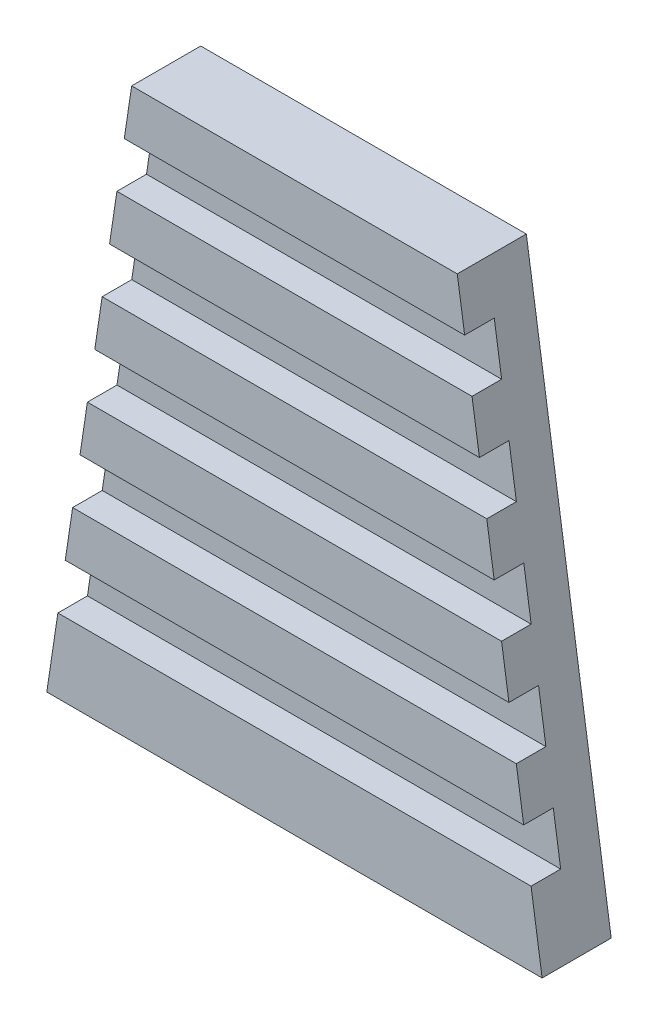
ISO-10303-21;
HEADER;
FILE_DESCRIPTION(('STEP AP214'),'2;1');
FILE_NAME('part.step','',(''),(''),'','','');
FILE_SCHEMA(('AUTOMOTIVE_DESIGN { 1 0 10303 214 1 1 1 1 }'));
ENDSEC;
DATA;
#1=APPLICATION_CONTEXT('core data for automotive mechanical design processes');
#2=APPLICATION_PROTOCOL_DEFINITION('international standard','automotive_design',2000,#1);
#3=PRODUCT_CONTEXT('',#1,'mechanical');
#4=PRODUCT('Part','Part','',(#3));
#5=PRODUCT_RELATED_PRODUCT_CATEGORY('part','',(#4));
#6=PRODUCT_DEFINITION_FORMATION('','',#4);
#7=PRODUCT_DEFINITION_CONTEXT('part definition',#1,'design');
#8=PRODUCT_DEFINITION('design','',#6,#7);
#9=PRODUCT_DEFINITION_SHAPE('','',#8);
#10=(LENGTH_UNIT() NAMED_UNIT(*) SI_UNIT(.MILLI.,.METRE.));
#11=(NAMED_UNIT(*) PLANE_ANGLE_UNIT() SI_UNIT($,.RADIAN.));
#12=(NAMED_UNIT(*) SI_UNIT($,.STERADIAN.) SOLID_ANGLE_UNIT());
#13=UNCERTAINTY_MEASURE_WITH_UNIT(LENGTH_MEASURE(1.E-05),#10,'distance_accuracy_value','');
#14=(GEOMETRIC_REPRESENTATION_CONTEXT(3) GLOBAL_UNCERTAINTY_ASSIGNED_CONTEXT((#13)) GLOBAL_UNIT_ASSIGNED_CONTEXT((#10,
#11,#12)) REPRESENTATION_CONTEXT('',''));
#15=CARTESIAN_POINT('',(0.,0.,0.));
#16=DIRECTION('',(0.,0.,1.));
#17=DIRECTION('',(1.,0.,0.));
#18=AXIS2_PLACEMENT_3D('',#15,#16,#17);
#19=CARTESIAN_POINT('',(-25.1,-28.75,4.));
#20=DIRECTION('',(0.,0.,-1.));
#21=DIRECTION('',(-1.,0.,0.));
#22=AXIS2_PLACEMENT_3D('',#19,#20,#21);
#23=PLANE('',#22);
#24=DIRECTION('',(1.,0.,0.));
#25=VECTOR('',#24,1.);
#26=CARTESIAN_POINT('',(-23.2304347826087,-16.25,4.));
#27=LINE('',#26,#25);
#28=CARTESIAN_POINT('',(-23.2304347826087,-16.25,4.));
#29=VERTEX_POINT('',#28);
#30=CARTESIAN_POINT('',(23.2304347826087,-16.25,4.));
#31=VERTEX_POINT('',#30);
#32=EDGE_CURVE('E393',#29,#31,#27,.T.);
#33=ORIENTED_EDGE('',*,*,#32,.F.);
#34=DIRECTION('',(-0.147919901899554,-0.988999344095852,0.));
#35=VECTOR('',#34,1.);
#36=CARTESIAN_POINT('',(-25.1,-28.75,4.));
#37=LINE('',#36,#35);
#38=CARTESIAN_POINT('',(-23.9782608695652,-21.25,4.));
#39=VERTEX_POINT('',#38);
#40=EDGE_CURVE('E217',#29,#39,#37,.T.);
#41=ORIENTED_EDGE('',*,*,#40,.T.);
#42=DIRECTION('',(-1.,0.,0.));
#43=VECTOR('',#42,1.);
#44=CARTESIAN_POINT('',(-23.9782608695652,-21.25,4.));
#45=LINE('',#44,#43);
#46=CARTESIAN_POINT('',(23.9782608695652,-21.25,4.));
#47=VERTEX_POINT('',#46);
#48=EDGE_CURVE('E324',#47,#39,#45,.T.);
#49=ORIENTED_EDGE('',*,*,#48,.F.);
#50=DIRECTION('',(-0.147919901899554,0.988999344095852,0.));
#51=VECTOR('',#50,1.);
#52=CARTESIAN_POINT('',(16.5,28.75,4.));
#53=LINE('',#52,#51);
#54=EDGE_CURVE('E56',#47,#31,#53,.T.);
#55=ORIENTED_EDGE('',*,*,#54,.T.);
#56=EDGE_LOOP('',(#33,#41,#49,#55));
#57=FACE_BOUND('',#56,.T.);
#58=ADVANCED_FACE('F30',(#57),#23,.F.);
#59=DIRECTION('',(-1.,0.,0.));
#60=VECTOR('',#59,1.);
#61=CARTESIAN_POINT('',(-22.4826086956522,-11.25,4.));
#62=LINE('',#61,#60);
#63=CARTESIAN_POINT('',(22.4826086956522,-11.25,4.));
#64=VERTEX_POINT('',#63);
#65=CARTESIAN_POINT('',(-22.4826086956522,-11.25,4.));
#66=VERTEX_POINT('',#65);
#67=EDGE_CURVE('E48',#64,#66,#62,.T.);
#68=ORIENTED_EDGE('',*,*,#67,.F.);
#69=CARTESIAN_POINT('',(21.7347826086956,-6.25,4.));
#70=VERTEX_POINT('',#69);
#71=EDGE_CURVE('E34',#64,#70,#53,.T.);
#72=ORIENTED_EDGE('',*,*,#71,.T.);
#73=DIRECTION('',(1.,0.,0.));
#74=VECTOR('',#73,1.);
#75=CARTESIAN_POINT('',(-21.7347826086957,-6.25000000000001,4.));
#76=LINE('',#75,#74);
#77=CARTESIAN_POINT('',(-21.7347826086957,-6.25000000000001,4.));
#78=VERTEX_POINT('',#77);
#79=EDGE_CURVE('E218',#78,#70,#76,.T.);
#80=ORIENTED_EDGE('',*,*,#79,.F.);
#81=EDGE_CURVE('E368',#78,#66,#37,.T.);
#82=ORIENTED_EDGE('',*,*,#81,.T.);
#83=EDGE_LOOP('',(#68,#72,#80,#82));
#84=FACE_BOUND('',#83,.T.);
#85=ADVANCED_FACE('F373',(#84),#23,.F.);
#86=DIRECTION('',(-1.,0.,0.));
#87=VECTOR('',#86,1.);
#88=CARTESIAN_POINT('',(-20.9869565217391,-1.25000000000001,4.));
#89=LINE('',#88,#87);
#90=CARTESIAN_POINT('',(20.9869565217391,-1.25000000000001,4.));
#91=VERTEX_POINT('',#90);
#92=CARTESIAN_POINT('',(-20.9869565217391,-1.25000000000002,4.));
#93=VERTEX_POINT('',#92);
#94=EDGE_CURVE('E221',#91,#93,#89,.T.);
#95=ORIENTED_EDGE('',*,*,#94,.F.);
#96=CARTESIAN_POINT('',(20.2391304347826,3.74999999999999,4.));
#97=VERTEX_POINT('',#96);
#98=EDGE_CURVE('E371',#91,#97,#53,.T.);
#99=ORIENTED_EDGE('',*,*,#98,.T.);
#100=DIRECTION('',(1.,0.,0.));
#101=VECTOR('',#100,1.);
#102=CARTESIAN_POINT('',(-20.2391304347826,3.74999999999999,4.));
#103=LINE('',#102,#101);
#104=CARTESIAN_POINT('',(-20.2391304347826,3.74999999999999,4.));
#105=VERTEX_POINT('',#104);
#106=EDGE_CURVE('E250',#105,#97,#103,.T.);
#107=ORIENTED_EDGE('',*,*,#106,.F.);
#108=EDGE_CURVE('E365',#105,#93,#37,.T.);
#109=ORIENTED_EDGE('',*,*,#108,.T.);
#110=EDGE_LOOP('',(#95,#99,#107,#109));
#111=FACE_BOUND('',#110,.T.);
#112=ADVANCED_FACE('F464',(#111),#23,.F.);
#113=DIRECTION('',(-1.,0.,0.));
#114=VECTOR('',#113,1.);
#115=CARTESIAN_POINT('',(-19.4913043478261,8.74999999999999,4.));
#116=LINE('',#115,#114);
#117=CARTESIAN_POINT('',(19.4913043478261,8.74999999999999,4.));
#118=VERTEX_POINT('',#117);
#119=CARTESIAN_POINT('',(-19.4913043478261,8.74999999999997,4.));
#120=VERTEX_POINT('',#119);
#121=EDGE_CURVE('E255',#118,#120,#116,.T.);
#122=ORIENTED_EDGE('',*,*,#121,.F.);
#123=CARTESIAN_POINT('',(18.7434782608696,13.75,4.));
#124=VERTEX_POINT('',#123);
#125=EDGE_CURVE('E370',#118,#124,#53,.T.);
#126=ORIENTED_EDGE('',*,*,#125,.T.);
#127=DIRECTION('',(1.,0.,0.));
#128=VECTOR('',#127,1.);
#129=CARTESIAN_POINT('',(-18.7434782608696,13.75,4.));
#130=LINE('',#129,#128);
#131=CARTESIAN_POINT('',(-18.7434782608696,13.75,4.));
#132=VERTEX_POINT('',#131);
#133=EDGE_CURVE('E277',#132,#124,#130,.T.);
#134=ORIENTED_EDGE('',*,*,#133,.F.);
#135=EDGE_CURVE('E355',#132,#120,#37,.T.);
#136=ORIENTED_EDGE('',*,*,#135,.T.);
#137=EDGE_LOOP('',(#122,#126,#134,#136));
#138=FACE_BOUND('',#137,.T.);
#139=ADVANCED_FACE('F448',(#138),#23,.F.);
#140=DIRECTION('',(-1.,0.,0.));
#141=VECTOR('',#140,1.);
#142=CARTESIAN_POINT('',(-17.995652173913,18.75,4.));
#143=LINE('',#142,#141);
#144=CARTESIAN_POINT('',(17.995652173913,18.75,4.));
#145=VERTEX_POINT('',#144);
#146=CARTESIAN_POINT('',(-17.995652173913,18.75,4.));
#147=VERTEX_POINT('',#146);
#148=EDGE_CURVE('E282',#145,#147,#143,.T.);
#149=ORIENTED_EDGE('',*,*,#148,.F.);
#150=CARTESIAN_POINT('',(17.2478260869565,23.75,4.));
#151=VERTEX_POINT('',#150);
#152=EDGE_CURVE('E422',#145,#151,#53,.T.);
#153=ORIENTED_EDGE('',*,*,#152,.T.);
#154=DIRECTION('',(1.,0.,0.));
#155=VECTOR('',#154,1.);
#156=CARTESIAN_POINT('',(-17.2478260869565,23.75,4.));
#157=LINE('',#156,#155);
#158=CARTESIAN_POINT('',(-17.2478260869565,23.75,4.));
#159=VERTEX_POINT('',#158);
#160=EDGE_CURVE('E304',#159,#151,#157,.T.);
#161=ORIENTED_EDGE('',*,*,#160,.F.);
#162=EDGE_CURVE('E352',#159,#147,#37,.T.);
#163=ORIENTED_EDGE('',*,*,#162,.T.);
#164=EDGE_LOOP('',(#149,#153,#161,#163));
#165=FACE_BOUND('',#164,.T.);
#166=ADVANCED_FACE('F444',(#165),#23,.F.);
#167=CARTESIAN_POINT('',(25.1,-28.75,4.));
#168=DIRECTION('',(0.,1.,0.));
#169=DIRECTION('',(0.,0.,1.));
#170=AXIS2_PLACEMENT_3D('',#167,#168,#169);
#171=PLANE('',#170);
#172=DIRECTION('',(1.,0.,0.));
#173=VECTOR('',#172,1.);
#174=CARTESIAN_POINT('',(25.1,-28.75,0.));
#175=LINE('',#174,#173);
#176=CARTESIAN_POINT('',(-25.1,-28.75,0.));
#177=VERTEX_POINT('',#176);
#178=CARTESIAN_POINT('',(25.1,-28.75,0.));
#179=VERTEX_POINT('',#178);
#180=EDGE_CURVE('E349',#177,#179,#175,.T.);
#181=ORIENTED_EDGE('',*,*,#180,.T.);
#182=DIRECTION('',(0.,0.,-1.));
#183=VECTOR('',#182,1.);
#184=CARTESIAN_POINT('',(25.1,-28.75,4.));
#185=LINE('',#184,#183);
#186=CARTESIAN_POINT('',(25.1,-28.75,7.));
#187=VERTEX_POINT('',#186);
#188=EDGE_CURVE('E11',#187,#179,#185,.T.);
#189=ORIENTED_EDGE('',*,*,#188,.F.);
#190=DIRECTION('',(1.,0.,0.));
#191=VECTOR('',#190,1.);
#192=CARTESIAN_POINT('',(-25.1,-28.75,7.));
#193=LINE('',#192,#191);
#194=CARTESIAN_POINT('',(-25.1,-28.75,7.));
#195=VERTEX_POINT('',#194);
#196=EDGE_CURVE('E328',#195,#187,#193,.T.);
#197=ORIENTED_EDGE('',*,*,#196,.F.);
#198=DIRECTION('',(0.,0.,-1.));
#199=VECTOR('',#198,1.);
#200=CARTESIAN_POINT('',(-25.1,-28.75,4.));
#201=LINE('',#200,#199);
#202=EDGE_CURVE('E354',#195,#177,#201,.T.);
#203=ORIENTED_EDGE('',*,*,#202,.T.);
#204=EDGE_LOOP('',(#181,#189,#197,#203));
#205=FACE_BOUND('',#204,.T.);
#206=ADVANCED_FACE('F32',(#205),#171,.F.);
#207=CARTESIAN_POINT('',(16.5,28.75,4.));
#208=DIRECTION('',(-0.988999344095852,-0.147919901899554,0.));
#209=DIRECTION('',(0.147919901899554,-0.988999344095853,0.));
#210=AXIS2_PLACEMENT_3D('',#207,#208,#209);
#211=PLANE('',#210);
#212=DIRECTION('',(-0.147919901899554,0.988999344095852,0.));
#213=VECTOR('',#212,1.);
#214=CARTESIAN_POINT('',(16.5,28.75,0.));
#215=LINE('',#214,#213);
#216=CARTESIAN_POINT('',(16.5,28.75,0.));
#217=VERTEX_POINT('',#216);
#218=EDGE_CURVE('E410',#179,#217,#215,.T.);
#219=ORIENTED_EDGE('',*,*,#218,.T.);
#220=DIRECTION('',(0.,0.,-1.));
#221=VECTOR('',#220,1.);
#222=CARTESIAN_POINT('',(16.5,28.75,4.));
#223=LINE('',#222,#221);
#224=CARTESIAN_POINT('',(16.5,28.75,7.));
#225=VERTEX_POINT('',#224);
#226=EDGE_CURVE('E40',#225,#217,#223,.T.);
#227=ORIENTED_EDGE('',*,*,#226,.F.);
#228=DIRECTION('',(-0.147919901899554,0.988999344095853,0.));
#229=VECTOR('',#228,1.);
#230=CARTESIAN_POINT('',(17.2478260869565,23.75,7.));
#231=LINE('',#230,#229);
#232=CARTESIAN_POINT('',(17.2478260869565,23.75,7.));
#233=VERTEX_POINT('',#232);
#234=EDGE_CURVE('E310',#233,#225,#231,.T.);
#235=ORIENTED_EDGE('',*,*,#234,.F.);
#236=DIRECTION('',(0.,0.,-1.));
#237=VECTOR('',#236,1.);
#238=CARTESIAN_POINT('',(17.2478260869565,23.75,7.));
#239=LINE('',#238,#237);
#240=EDGE_CURVE('E316',#233,#151,#239,.T.);
#241=ORIENTED_EDGE('',*,*,#240,.T.);
#242=ORIENTED_EDGE('',*,*,#152,.F.);
#243=DIRECTION('',(0.,0.,-1.));
#244=VECTOR('',#243,1.);
#245=CARTESIAN_POINT('',(17.9956521739131,18.75,7.));
#246=LINE('',#245,#244);
#247=CARTESIAN_POINT('',(17.9956521739131,18.75,7.));
#248=VERTEX_POINT('',#247);
#249=EDGE_CURVE('E295',#248,#145,#246,.T.);
#250=ORIENTED_EDGE('',*,*,#249,.F.);
#251=DIRECTION('',(-0.147919901899552,0.988999344095853,0.));
#252=VECTOR('',#251,1.);
#253=CARTESIAN_POINT('',(18.7434782608696,13.75,7.));
#254=LINE('',#253,#252);
#255=CARTESIAN_POINT('',(18.7434782608696,13.75,7.));
#256=VERTEX_POINT('',#255);
#257=EDGE_CURVE('E284',#256,#248,#254,.T.);
#258=ORIENTED_EDGE('',*,*,#257,.F.);
#259=DIRECTION('',(0.,0.,-1.));
#260=VECTOR('',#259,1.);
#261=CARTESIAN_POINT('',(18.7434782608696,13.75,7.));
#262=LINE('',#261,#260);
#263=EDGE_CURVE('E298',#256,#124,#262,.T.);
#264=ORIENTED_EDGE('',*,*,#263,.T.);
#265=ORIENTED_EDGE('',*,*,#125,.F.);
#266=DIRECTION('',(0.,0.,-1.));
#267=VECTOR('',#266,1.);
#268=CARTESIAN_POINT('',(19.4913043478261,8.74999999999999,7.));
#269=LINE('',#268,#267);
#270=CARTESIAN_POINT('',(19.4913043478261,8.74999999999999,7.));
#271=VERTEX_POINT('',#270);
#272=EDGE_CURVE('E268',#271,#118,#269,.T.);
#273=ORIENTED_EDGE('',*,*,#272,.F.);
#274=DIRECTION('',(-0.147919901899556,0.988999344095852,0.));
#275=VECTOR('',#274,1.);
#276=CARTESIAN_POINT('',(20.2391304347826,3.74999999999999,7.));
#277=LINE('',#276,#275);
#278=CARTESIAN_POINT('',(20.2391304347826,3.74999999999999,7.));
#279=VERTEX_POINT('',#278);
#280=EDGE_CURVE('E257',#279,#271,#277,.T.);
#281=ORIENTED_EDGE('',*,*,#280,.F.);
#282=DIRECTION('',(0.,0.,-1.));
#283=VECTOR('',#282,1.);
#284=CARTESIAN_POINT('',(20.2391304347826,3.74999999999999,7.));
#285=LINE('',#284,#283);
#286=EDGE_CURVE('E271',#279,#97,#285,.T.);
#287=ORIENTED_EDGE('',*,*,#286,.T.);
#288=ORIENTED_EDGE('',*,*,#98,.F.);
#289=DIRECTION('',(0.,0.,-1.));
#290=VECTOR('',#289,1.);
#291=CARTESIAN_POINT('',(20.9869565217391,-1.25000000000001,7.));
#292=LINE('',#291,#290);
#293=CARTESIAN_POINT('',(20.9869565217391,-1.25000000000001,7.));
#294=VERTEX_POINT('',#293);
#295=EDGE_CURVE('E241',#294,#91,#292,.T.);
#296=ORIENTED_EDGE('',*,*,#295,.F.);
#297=DIRECTION('',(-0.147919901899553,0.988999344095853,0.));
#298=VECTOR('',#297,1.);
#299=CARTESIAN_POINT('',(21.7347826086956,-6.25000000000001,7.));
#300=LINE('',#299,#298);
#301=CARTESIAN_POINT('',(21.7347826086956,-6.25000000000001,7.));
#302=VERTEX_POINT('',#301);
#303=EDGE_CURVE('E232',#302,#294,#300,.T.);
#304=ORIENTED_EDGE('',*,*,#303,.F.);
#305=DIRECTION('',(0.,0.,-1.));
#306=VECTOR('',#305,1.);
#307=CARTESIAN_POINT('',(21.7347826086956,-6.25000000000001,7.));
#308=LINE('',#307,#306);
#309=EDGE_CURVE('E244',#302,#70,#308,.T.);
#310=ORIENTED_EDGE('',*,*,#309,.T.);
#311=ORIENTED_EDGE('',*,*,#71,.F.);
#312=DIRECTION('',(0.,0.,-1.));
#313=VECTOR('',#312,1.);
#314=CARTESIAN_POINT('',(22.4826086956522,-11.25,7.));
#315=LINE('',#314,#313);
#316=CARTESIAN_POINT('',(22.4826086956522,-11.25,7.));
#317=VERTEX_POINT('',#316);
#318=EDGE_CURVE('E223',#317,#64,#315,.T.);
#319=ORIENTED_EDGE('',*,*,#318,.F.);
#320=DIRECTION('',(-0.147919901899552,0.988999344095853,0.));
#321=VECTOR('',#320,1.);
#322=CARTESIAN_POINT('',(23.2304347826087,-16.25,7.));
#323=LINE('',#322,#321);
#324=CARTESIAN_POINT('',(23.2304347826087,-16.25,7.));
#325=VERTEX_POINT('',#324);
#326=EDGE_CURVE('E204',#325,#317,#323,.T.);
#327=ORIENTED_EDGE('',*,*,#326,.F.);
#328=DIRECTION('',(0.,0.,-1.));
#329=VECTOR('',#328,1.);
#330=CARTESIAN_POINT('',(23.2304347826087,-16.25,7.));
#331=LINE('',#330,#329);
#332=EDGE_CURVE('E201',#325,#31,#331,.T.);
#333=ORIENTED_EDGE('',*,*,#332,.T.);
#334=ORIENTED_EDGE('',*,*,#54,.F.);
#335=DIRECTION('',(0.,0.,-1.));
#336=VECTOR('',#335,1.);
#337=CARTESIAN_POINT('',(23.9782608695652,-21.25,7.));
#338=LINE('',#337,#336);
#339=CARTESIAN_POINT('',(23.9782608695652,-21.25,7.));
#340=VERTEX_POINT('',#339);
#341=EDGE_CURVE('E344',#340,#47,#338,.T.);
#342=ORIENTED_EDGE('',*,*,#341,.F.);
#343=DIRECTION('',(-0.147919901899554,0.988999344095853,0.));
#344=VECTOR('',#343,1.);
#345=CARTESIAN_POINT('',(25.1,-28.75,7.));
#346=LINE('',#345,#344);
#347=EDGE_CURVE('E331',#187,#340,#346,.T.);
#348=ORIENTED_EDGE('',*,*,#347,.F.);
#349=ORIENTED_EDGE('',*,*,#188,.T.);
#350=EDGE_LOOP('',(#219,#227,#235,#241,#242,#250,#258,#264,#265,#273,#281,#287,#288,#296,#304,
#310,#311,#319,#327,#333,#334,#342,#348,#349));
#351=FACE_BOUND('',#350,.T.);
#352=ADVANCED_FACE('F382',(#351),#211,.F.);
#353=CARTESIAN_POINT('',(-16.5,28.75,4.));
#354=DIRECTION('',(0.,-1.,0.));
#355=DIRECTION('',(0.,0.,-1.));
#356=AXIS2_PLACEMENT_3D('',#353,#354,#355);
#357=PLANE('',#356);
#358=DIRECTION('',(-1.,0.,0.));
#359=VECTOR('',#358,1.);
#360=CARTESIAN_POINT('',(-16.5,28.75,0.));
#361=LINE('',#360,#359);
#362=CARTESIAN_POINT('',(-16.5,28.75,0.));
#363=VERTEX_POINT('',#362);
#364=EDGE_CURVE('E417',#217,#363,#361,.T.);
#365=ORIENTED_EDGE('',*,*,#364,.T.);
#366=DIRECTION('',(0.,0.,-1.));
#367=VECTOR('',#366,1.);
#368=CARTESIAN_POINT('',(-16.5,28.75,4.));
#369=LINE('',#368,#367);
#370=CARTESIAN_POINT('',(-16.5,28.75,7.));
#371=VERTEX_POINT('',#370);
#372=EDGE_CURVE('E424',#371,#363,#369,.T.);
#373=ORIENTED_EDGE('',*,*,#372,.F.);
#374=DIRECTION('',(-1.,0.,0.));
#375=VECTOR('',#374,1.);
#376=CARTESIAN_POINT('',(16.5,28.75,7.));
#377=LINE('',#376,#375);
#378=EDGE_CURVE('E313',#225,#371,#377,.T.);
#379=ORIENTED_EDGE('',*,*,#378,.F.);
#380=ORIENTED_EDGE('',*,*,#226,.T.);
#381=EDGE_LOOP('',(#365,#373,#379,#380));
#382=FACE_BOUND('',#381,.T.);
#383=ADVANCED_FACE('F430',(#382),#357,.F.);
#384=CARTESIAN_POINT('',(-25.1,-28.75,4.));
#385=DIRECTION('',(0.988999344095852,-0.147919901899554,0.));
#386=DIRECTION('',(0.147919901899554,0.988999344095853,0.));
#387=AXIS2_PLACEMENT_3D('',#384,#385,#386);
#388=PLANE('',#387);
#389=DIRECTION('',(-0.147919901899554,-0.988999344095852,0.));
#390=VECTOR('',#389,1.);
#391=CARTESIAN_POINT('',(-25.1,-28.75,0.));
#392=LINE('',#391,#390);
#393=EDGE_CURVE('E418',#363,#177,#392,.T.);
#394=ORIENTED_EDGE('',*,*,#393,.T.);
#395=ORIENTED_EDGE('',*,*,#202,.F.);
#396=DIRECTION('',(-0.147919901899554,-0.988999344095853,0.));
#397=VECTOR('',#396,1.);
#398=CARTESIAN_POINT('',(-23.9782608695652,-21.25,7.));
#399=LINE('',#398,#397);
#400=CARTESIAN_POINT('',(-23.9782608695652,-21.25,7.));
#401=VERTEX_POINT('',#400);
#402=EDGE_CURVE('E325',#401,#195,#399,.T.);
#403=ORIENTED_EDGE('',*,*,#402,.F.);
#404=DIRECTION('',(0.,0.,-1.));
#405=VECTOR('',#404,1.);
#406=CARTESIAN_POINT('',(-23.9782608695652,-21.25,7.));
#407=LINE('',#406,#405);
#408=EDGE_CURVE('E335',#401,#39,#407,.T.);
#409=ORIENTED_EDGE('',*,*,#408,.T.);
#410=ORIENTED_EDGE('',*,*,#40,.F.);
#411=DIRECTION('',(0.,0.,-1.));
#412=VECTOR('',#411,1.);
#413=CARTESIAN_POINT('',(-23.2304347826087,-16.25,7.));
#414=LINE('',#413,#412);
#415=CARTESIAN_POINT('',(-23.2304347826087,-16.25,7.));
#416=VERTEX_POINT('',#415);
#417=EDGE_CURVE('E199',#416,#29,#414,.T.);
#418=ORIENTED_EDGE('',*,*,#417,.F.);
#419=DIRECTION('',(-0.147919901899554,-0.988999344095853,0.));
#420=VECTOR('',#419,1.);
#421=CARTESIAN_POINT('',(-22.4826086956522,-11.25,7.));
#422=LINE('',#421,#420);
#423=CARTESIAN_POINT('',(-22.4826086956522,-11.25,7.));
#424=VERTEX_POINT('',#423);
#425=EDGE_CURVE('E205',#424,#416,#422,.T.);
#426=ORIENTED_EDGE('',*,*,#425,.F.);
#427=DIRECTION('',(0.,0.,-1.));
#428=VECTOR('',#427,1.);
#429=CARTESIAN_POINT('',(-22.4826086956522,-11.25,7.));
#430=LINE('',#429,#428);
#431=EDGE_CURVE('E390',#424,#66,#430,.T.);
#432=ORIENTED_EDGE('',*,*,#431,.T.);
#433=ORIENTED_EDGE('',*,*,#81,.F.);
#434=DIRECTION('',(0.,0.,-1.));
#435=VECTOR('',#434,1.);
#436=CARTESIAN_POINT('',(-21.7347826086957,-6.25000000000001,7.));
#437=LINE('',#436,#435);
#438=CARTESIAN_POINT('',(-21.7347826086957,-6.25000000000001,7.));
#439=VERTEX_POINT('',#438);
#440=EDGE_CURVE('E247',#439,#78,#437,.T.);
#441=ORIENTED_EDGE('',*,*,#440,.F.);
#442=DIRECTION('',(-0.147919901899554,-0.988999344095853,0.));
#443=VECTOR('',#442,1.);
#444=CARTESIAN_POINT('',(-20.9869565217391,-1.25000000000001,7.));
#445=LINE('',#444,#443);
#446=CARTESIAN_POINT('',(-20.9869565217391,-1.25000000000001,7.));
#447=VERTEX_POINT('',#446);
#448=EDGE_CURVE('E227',#447,#439,#445,.T.);
#449=ORIENTED_EDGE('',*,*,#448,.F.);
#450=DIRECTION('',(0.,0.,-1.));
#451=VECTOR('',#450,1.);
#452=CARTESIAN_POINT('',(-20.9869565217391,-1.25000000000001,7.));
#453=LINE('',#452,#451);
#454=EDGE_CURVE('E235',#447,#93,#453,.T.);
#455=ORIENTED_EDGE('',*,*,#454,.T.);
#456=ORIENTED_EDGE('',*,*,#108,.F.);
#457=DIRECTION('',(0.,0.,-1.));
#458=VECTOR('',#457,1.);
#459=CARTESIAN_POINT('',(-20.2391304347826,3.74999999999999,7.));
#460=LINE('',#459,#458);
#461=CARTESIAN_POINT('',(-20.2391304347826,3.74999999999999,7.));
#462=VERTEX_POINT('',#461);
#463=EDGE_CURVE('E274',#462,#105,#460,.T.);
#464=ORIENTED_EDGE('',*,*,#463,.F.);
#465=DIRECTION('',(-0.147919901899554,-0.988999344095853,0.));
#466=VECTOR('',#465,1.);
#467=CARTESIAN_POINT('',(-19.4913043478261,8.74999999999999,7.));
#468=LINE('',#467,#466);
#469=CARTESIAN_POINT('',(-19.4913043478261,8.74999999999999,7.));
#470=VERTEX_POINT('',#469);
#471=EDGE_CURVE('E251',#470,#462,#468,.T.);
#472=ORIENTED_EDGE('',*,*,#471,.F.);
#473=DIRECTION('',(0.,0.,-1.));
#474=VECTOR('',#473,1.);
#475=CARTESIAN_POINT('',(-19.4913043478261,8.74999999999999,7.));
#476=LINE('',#475,#474);
#477=EDGE_CURVE('E261',#470,#120,#476,.T.);
#478=ORIENTED_EDGE('',*,*,#477,.T.);
#479=ORIENTED_EDGE('',*,*,#135,.F.);
#480=DIRECTION('',(0.,0.,-1.));
#481=VECTOR('',#480,1.);
#482=CARTESIAN_POINT('',(-18.7434782608696,13.75,7.));
#483=LINE('',#482,#481);
#484=CARTESIAN_POINT('',(-18.7434782608696,13.75,7.));
#485=VERTEX_POINT('',#484);
#486=EDGE_CURVE('E301',#485,#132,#483,.T.);
#487=ORIENTED_EDGE('',*,*,#486,.F.);
#488=DIRECTION('',(-0.147919901899554,-0.988999344095853,0.));
#489=VECTOR('',#488,1.);
#490=CARTESIAN_POINT('',(-17.995652173913,18.75,7.));
#491=LINE('',#490,#489);
#492=CARTESIAN_POINT('',(-17.995652173913,18.75,7.));
#493=VERTEX_POINT('',#492);
#494=EDGE_CURVE('E278',#493,#485,#491,.T.);
#495=ORIENTED_EDGE('',*,*,#494,.F.);
#496=DIRECTION('',(0.,0.,-1.));
#497=VECTOR('',#496,1.);
#498=CARTESIAN_POINT('',(-17.995652173913,18.75,7.));
#499=LINE('',#498,#497);
#500=EDGE_CURVE('E288',#493,#147,#499,.T.);
#501=ORIENTED_EDGE('',*,*,#500,.T.);
#502=ORIENTED_EDGE('',*,*,#162,.F.);
#503=DIRECTION('',(0.,0.,-1.));
#504=VECTOR('',#503,1.);
#505=CARTESIAN_POINT('',(-17.2478260869565,23.75,7.));
#506=LINE('',#505,#504);
#507=CARTESIAN_POINT('',(-17.2478260869565,23.75,7.));
#508=VERTEX_POINT('',#507);
#509=EDGE_CURVE('E321',#508,#159,#506,.T.);
#510=ORIENTED_EDGE('',*,*,#509,.F.);
#511=DIRECTION('',(-0.147919901899554,-0.988999344095853,0.));
#512=VECTOR('',#511,1.);
#513=CARTESIAN_POINT('',(-16.5,28.75,7.));
#514=LINE('',#513,#512);
#515=EDGE_CURVE('E305',#371,#508,#514,.T.);
#516=ORIENTED_EDGE('',*,*,#515,.F.);
#517=ORIENTED_EDGE('',*,*,#372,.T.);
#518=EDGE_LOOP('',(#394,#395,#403,#409,#410,#418,#426,#432,#433,#441,#449,#455,#456,#464,#472,
#478,#479,#487,#495,#501,#502,#510,#516,#517));
#519=FACE_BOUND('',#518,.T.);
#520=ADVANCED_FACE('F215',(#519),#388,.F.);
#521=CARTESIAN_POINT('',(-25.1,-28.75,0.));
#522=DIRECTION('',(0.,0.,-1.));
#523=DIRECTION('',(-1.,0.,0.));
#524=AXIS2_PLACEMENT_3D('',#521,#522,#523);
#525=PLANE('',#524);
#526=ORIENTED_EDGE('',*,*,#180,.F.);
#527=ORIENTED_EDGE('',*,*,#393,.F.);
#528=ORIENTED_EDGE('',*,*,#364,.F.);
#529=ORIENTED_EDGE('',*,*,#218,.F.);
#530=EDGE_LOOP('',(#526,#527,#528,#529));
#531=FACE_BOUND('',#530,.T.);
#532=ADVANCED_FACE('F432',(#531),#525,.T.);
#533=CARTESIAN_POINT('',(-23.9782608695652,-21.25,7.));
#534=DIRECTION('',(0.,-1.,0.));
#535=DIRECTION('',(0.,0.,-1.));
#536=AXIS2_PLACEMENT_3D('',#533,#534,#535);
#537=PLANE('',#536);
#538=ORIENTED_EDGE('',*,*,#48,.T.);
#539=ORIENTED_EDGE('',*,*,#408,.F.);
#540=DIRECTION('',(-1.,0.,0.));
#541=VECTOR('',#540,1.);
#542=CARTESIAN_POINT('',(-23.9782608695652,-21.25,7.));
#543=LINE('',#542,#541);
#544=EDGE_CURVE('E333',#340,#401,#543,.T.);
#545=ORIENTED_EDGE('',*,*,#544,.F.);
#546=ORIENTED_EDGE('',*,*,#341,.T.);
#547=EDGE_LOOP('',(#538,#539,#545,#546));
#548=FACE_BOUND('',#547,.T.);
#549=ADVANCED_FACE('F403',(#548),#537,.F.);
#550=CARTESIAN_POINT('',(-25.1,-28.75,7.));
#551=DIRECTION('',(0.,0.,1.));
#552=DIRECTION('',(1.,0.,0.));
#553=AXIS2_PLACEMENT_3D('',#550,#551,#552);
#554=PLANE('',#553);
#555=ORIENTED_EDGE('',*,*,#402,.T.);
#556=ORIENTED_EDGE('',*,*,#196,.T.);
#557=ORIENTED_EDGE('',*,*,#347,.T.);
#558=ORIENTED_EDGE('',*,*,#544,.T.);
#559=EDGE_LOOP('',(#555,#556,#557,#558));
#560=FACE_BOUND('',#559,.T.);
#561=ADVANCED_FACE('F407',(#560),#554,.T.);
#562=CARTESIAN_POINT('',(-17.2478260869565,23.75,7.));
#563=DIRECTION('',(0.,1.,0.));
#564=DIRECTION('',(0.,0.,1.));
#565=AXIS2_PLACEMENT_3D('',#562,#563,#564);
#566=PLANE('',#565);
#567=ORIENTED_EDGE('',*,*,#160,.T.);
#568=ORIENTED_EDGE('',*,*,#240,.F.);
#569=DIRECTION('',(1.,0.,0.));
#570=VECTOR('',#569,1.);
#571=CARTESIAN_POINT('',(-17.2478260869565,23.75,7.));
#572=LINE('',#571,#570);
#573=EDGE_CURVE('E308',#508,#233,#572,.T.);
#574=ORIENTED_EDGE('',*,*,#573,.F.);
#575=ORIENTED_EDGE('',*,*,#509,.T.);
#576=EDGE_LOOP('',(#567,#568,#574,#575));
#577=FACE_BOUND('',#576,.T.);
#578=ADVANCED_FACE('F441',(#577),#566,.F.);
#579=CARTESIAN_POINT('',(-17.2478260869565,23.75,7.));
#580=DIRECTION('',(0.,0.,1.));
#581=DIRECTION('',(1.,0.,0.));
#582=AXIS2_PLACEMENT_3D('',#579,#580,#581);
#583=PLANE('',#582);
#584=ORIENTED_EDGE('',*,*,#515,.T.);
#585=ORIENTED_EDGE('',*,*,#573,.T.);
#586=ORIENTED_EDGE('',*,*,#234,.T.);
#587=ORIENTED_EDGE('',*,*,#378,.T.);
#588=EDGE_LOOP('',(#584,#585,#586,#587));
#589=FACE_BOUND('',#588,.T.);
#590=ADVANCED_FACE('F436',(#589),#583,.T.);
#591=CARTESIAN_POINT('',(-18.7434782608696,13.75,7.));
#592=DIRECTION('',(0.,1.,0.));
#593=DIRECTION('',(0.,0.,1.));
#594=AXIS2_PLACEMENT_3D('',#591,#592,#593);
#595=PLANE('',#594);
#596=ORIENTED_EDGE('',*,*,#133,.T.);
#597=ORIENTED_EDGE('',*,*,#263,.F.);
#598=DIRECTION('',(1.,0.,0.));
#599=VECTOR('',#598,1.);
#600=CARTESIAN_POINT('',(-18.7434782608696,13.75,7.));
#601=LINE('',#600,#599);
#602=EDGE_CURVE('E281',#485,#256,#601,.T.);
#603=ORIENTED_EDGE('',*,*,#602,.F.);
#604=ORIENTED_EDGE('',*,*,#486,.T.);
#605=EDGE_LOOP('',(#596,#597,#603,#604));
#606=FACE_BOUND('',#605,.T.);
#607=ADVANCED_FACE('F452',(#606),#595,.F.);
#608=CARTESIAN_POINT('',(-17.995652173913,18.75,7.));
#609=DIRECTION('',(0.,-1.,0.));
#610=DIRECTION('',(0.,0.,-1.));
#611=AXIS2_PLACEMENT_3D('',#608,#609,#610);
#612=PLANE('',#611);
#613=ORIENTED_EDGE('',*,*,#148,.T.);
#614=ORIENTED_EDGE('',*,*,#500,.F.);
#615=DIRECTION('',(-1.,0.,0.));
#616=VECTOR('',#615,1.);
#617=CARTESIAN_POINT('',(-17.995652173913,18.75,7.));
#618=LINE('',#617,#616);
#619=EDGE_CURVE('E286',#248,#493,#618,.T.);
#620=ORIENTED_EDGE('',*,*,#619,.F.);
#621=ORIENTED_EDGE('',*,*,#249,.T.);
#622=EDGE_LOOP('',(#613,#614,#620,#621));
#623=FACE_BOUND('',#622,.T.);
#624=ADVANCED_FACE('F547',(#623),#612,.F.);
#625=CARTESIAN_POINT('',(-18.7434782608696,13.75,7.));
#626=DIRECTION('',(0.,0.,1.));
#627=DIRECTION('',(1.,0.,0.));
#628=AXIS2_PLACEMENT_3D('',#625,#626,#627);
#629=PLANE('',#628);
#630=ORIENTED_EDGE('',*,*,#494,.T.);
#631=ORIENTED_EDGE('',*,*,#602,.T.);
#632=ORIENTED_EDGE('',*,*,#257,.T.);
#633=ORIENTED_EDGE('',*,*,#619,.T.);
#634=EDGE_LOOP('',(#630,#631,#632,#633));
#635=FACE_BOUND('',#634,.T.);
#636=ADVANCED_FACE('F457',(#635),#629,.T.);
#637=CARTESIAN_POINT('',(-20.2391304347826,3.74999999999999,7.));
#638=DIRECTION('',(0.,1.,0.));
#639=DIRECTION('',(0.,0.,1.));
#640=AXIS2_PLACEMENT_3D('',#637,#638,#639);
#641=PLANE('',#640);
#642=ORIENTED_EDGE('',*,*,#106,.T.);
#643=ORIENTED_EDGE('',*,*,#286,.F.);
#644=DIRECTION('',(1.,0.,0.));
#645=VECTOR('',#644,1.);
#646=CARTESIAN_POINT('',(-20.2391304347826,3.74999999999999,7.));
#647=LINE('',#646,#645);
#648=EDGE_CURVE('E254',#462,#279,#647,.T.);
#649=ORIENTED_EDGE('',*,*,#648,.F.);
#650=ORIENTED_EDGE('',*,*,#463,.T.);
#651=EDGE_LOOP('',(#642,#643,#649,#650));
#652=FACE_BOUND('',#651,.T.);
#653=ADVANCED_FACE('F561',(#652),#641,.F.);
#654=CARTESIAN_POINT('',(-19.4913043478261,8.74999999999999,7.));
#655=DIRECTION('',(0.,-1.,0.));
#656=DIRECTION('',(0.,0.,-1.));
#657=AXIS2_PLACEMENT_3D('',#654,#655,#656);
#658=PLANE('',#657);
#659=ORIENTED_EDGE('',*,*,#121,.T.);
#660=ORIENTED_EDGE('',*,*,#477,.F.);
#661=DIRECTION('',(-1.,0.,0.));
#662=VECTOR('',#661,1.);
#663=CARTESIAN_POINT('',(-19.4913043478261,8.74999999999999,7.));
#664=LINE('',#663,#662);
#665=EDGE_CURVE('E259',#271,#470,#664,.T.);
#666=ORIENTED_EDGE('',*,*,#665,.F.);
#667=ORIENTED_EDGE('',*,*,#272,.T.);
#668=EDGE_LOOP('',(#659,#660,#666,#667));
#669=FACE_BOUND('',#668,.T.);
#670=ADVANCED_FACE('F568',(#669),#658,.F.);
#671=CARTESIAN_POINT('',(-20.2391304347826,3.74999999999999,7.));
#672=DIRECTION('',(0.,0.,1.));
#673=DIRECTION('',(1.,0.,0.));
#674=AXIS2_PLACEMENT_3D('',#671,#672,#673);
#675=PLANE('',#674);
#676=ORIENTED_EDGE('',*,*,#471,.T.);
#677=ORIENTED_EDGE('',*,*,#648,.T.);
#678=ORIENTED_EDGE('',*,*,#280,.T.);
#679=ORIENTED_EDGE('',*,*,#665,.T.);
#680=EDGE_LOOP('',(#676,#677,#678,#679));
#681=FACE_BOUND('',#680,.T.);
#682=ADVANCED_FACE('F475',(#681),#675,.T.);
#683=CARTESIAN_POINT('',(-21.7347826086957,-6.25000000000001,7.));
#684=DIRECTION('',(0.,1.,0.));
#685=DIRECTION('',(0.,0.,1.));
#686=AXIS2_PLACEMENT_3D('',#683,#684,#685);
#687=PLANE('',#686);
#688=ORIENTED_EDGE('',*,*,#79,.T.);
#689=ORIENTED_EDGE('',*,*,#309,.F.);
#690=DIRECTION('',(1.,0.,0.));
#691=VECTOR('',#690,1.);
#692=CARTESIAN_POINT('',(-21.7347826086957,-6.25000000000001,7.));
#693=LINE('',#692,#691);
#694=EDGE_CURVE('E230',#439,#302,#693,.T.);
#695=ORIENTED_EDGE('',*,*,#694,.F.);
#696=ORIENTED_EDGE('',*,*,#440,.T.);
#697=EDGE_LOOP('',(#688,#689,#695,#696));
#698=FACE_BOUND('',#697,.T.);
#699=ADVANCED_FACE('F379',(#698),#687,.F.);
#700=CARTESIAN_POINT('',(-20.9869565217391,-1.25000000000001,7.));
#701=DIRECTION('',(0.,-1.,0.));
#702=DIRECTION('',(0.,0.,-1.));
#703=AXIS2_PLACEMENT_3D('',#700,#701,#702);
#704=PLANE('',#703);
#705=ORIENTED_EDGE('',*,*,#94,.T.);
#706=ORIENTED_EDGE('',*,*,#454,.F.);
#707=DIRECTION('',(-1.,0.,0.));
#708=VECTOR('',#707,1.);
#709=CARTESIAN_POINT('',(-20.9869565217391,-1.25000000000001,7.));
#710=LINE('',#709,#708);
#711=EDGE_CURVE('E234',#294,#447,#710,.T.);
#712=ORIENTED_EDGE('',*,*,#711,.F.);
#713=ORIENTED_EDGE('',*,*,#295,.T.);
#714=EDGE_LOOP('',(#705,#706,#712,#713));
#715=FACE_BOUND('',#714,.T.);
#716=ADVANCED_FACE('F467',(#715),#704,.F.);
#717=CARTESIAN_POINT('',(-21.7347826086957,-6.25000000000001,7.));
#718=DIRECTION('',(0.,0.,1.));
#719=DIRECTION('',(1.,0.,0.));
#720=AXIS2_PLACEMENT_3D('',#717,#718,#719);
#721=PLANE('',#720);
#722=ORIENTED_EDGE('',*,*,#448,.T.);
#723=ORIENTED_EDGE('',*,*,#694,.T.);
#724=ORIENTED_EDGE('',*,*,#303,.T.);
#725=ORIENTED_EDGE('',*,*,#711,.T.);
#726=EDGE_LOOP('',(#722,#723,#724,#725));
#727=FACE_BOUND('',#726,.T.);
#728=ADVANCED_FACE('F387',(#727),#721,.T.);
#729=CARTESIAN_POINT('',(-23.2304347826087,-16.25,7.));
#730=DIRECTION('',(0.,1.,0.));
#731=DIRECTION('',(0.,0.,1.));
#732=AXIS2_PLACEMENT_3D('',#729,#730,#731);
#733=PLANE('',#732);
#734=ORIENTED_EDGE('',*,*,#32,.T.);
#735=ORIENTED_EDGE('',*,*,#332,.F.);
#736=DIRECTION('',(1.,0.,0.));
#737=VECTOR('',#736,1.);
#738=CARTESIAN_POINT('',(-23.2304347826087,-16.25,7.));
#739=LINE('',#738,#737);
#740=EDGE_CURVE('E195',#416,#325,#739,.T.);
#741=ORIENTED_EDGE('',*,*,#740,.F.);
#742=ORIENTED_EDGE('',*,*,#417,.T.);
#743=EDGE_LOOP('',(#734,#735,#741,#742));
#744=FACE_BOUND('',#743,.T.);
#745=ADVANCED_FACE('F197',(#744),#733,.F.);
#746=CARTESIAN_POINT('',(-22.4826086956522,-11.25,7.));
#747=DIRECTION('',(0.,-1.,0.));
#748=DIRECTION('',(0.,0.,-1.));
#749=AXIS2_PLACEMENT_3D('',#746,#747,#748);
#750=PLANE('',#749);
#751=ORIENTED_EDGE('',*,*,#67,.T.);
#752=ORIENTED_EDGE('',*,*,#431,.F.);
#753=DIRECTION('',(-1.,0.,0.));
#754=VECTOR('',#753,1.);
#755=CARTESIAN_POINT('',(-22.4826086956522,-11.25,7.));
#756=LINE('',#755,#754);
#757=EDGE_CURVE('E210',#317,#424,#756,.T.);
#758=ORIENTED_EDGE('',*,*,#757,.F.);
#759=ORIENTED_EDGE('',*,*,#318,.T.);
#760=EDGE_LOOP('',(#751,#752,#758,#759));
#761=FACE_BOUND('',#760,.T.);
#762=ADVANCED_FACE('F392',(#761),#750,.F.);
#763=CARTESIAN_POINT('',(-23.2304347826087,-16.25,7.));
#764=DIRECTION('',(0.,0.,1.));
#765=DIRECTION('',(1.,0.,0.));
#766=AXIS2_PLACEMENT_3D('',#763,#764,#765);
#767=PLANE('',#766);
#768=ORIENTED_EDGE('',*,*,#425,.T.);
#769=ORIENTED_EDGE('',*,*,#740,.T.);
#770=ORIENTED_EDGE('',*,*,#326,.T.);
#771=ORIENTED_EDGE('',*,*,#757,.T.);
#772=EDGE_LOOP('',(#768,#769,#770,#771));
#773=FACE_BOUND('',#772,.T.);
#774=ADVANCED_FACE('F208',(#773),#767,.T.);
#775=CLOSED_SHELL('',(#58,#85,#112,#139,#166,#206,#352,#383,#520,#532,#549,#561,#578,#590,#607,
#624,#636,#653,#670,#682,#699,#716,#728,#745,#762,#774));
#776=MANIFOLD_SOLID_BREP('B2',#775);
#777=ADVANCED_BREP_SHAPE_REPRESENTATION('',(#18,#776),#14);
#778=SHAPE_DEFINITION_REPRESENTATION(#9,#777);
ENDSEC;
END-ISO-10303-21;
